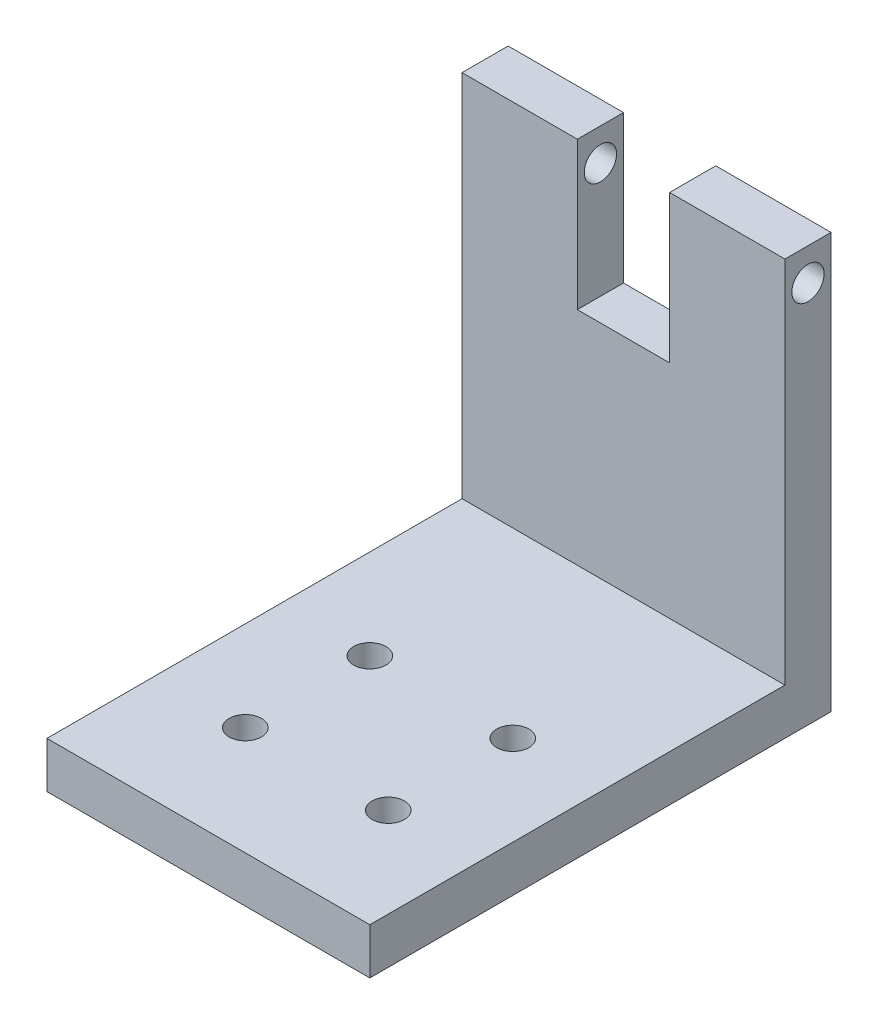
ISO-10303-21;
HEADER;
FILE_DESCRIPTION(('STEP AP214'),'2;1');
FILE_NAME('part.step','',(''),(''),'','','');
FILE_SCHEMA(('AUTOMOTIVE_DESIGN { 1 0 10303 214 1 1 1 1 }'));
ENDSEC;
DATA;
#1=APPLICATION_CONTEXT('core data for automotive mechanical design processes');
#2=APPLICATION_PROTOCOL_DEFINITION('international standard','automotive_design',2000,#1);
#3=PRODUCT_CONTEXT('',#1,'mechanical');
#4=PRODUCT('Part','Part','',(#3));
#5=PRODUCT_RELATED_PRODUCT_CATEGORY('part','',(#4));
#6=PRODUCT_DEFINITION_FORMATION('','',#4);
#7=PRODUCT_DEFINITION_CONTEXT('part definition',#1,'design');
#8=PRODUCT_DEFINITION('design','',#6,#7);
#9=PRODUCT_DEFINITION_SHAPE('','',#8);
#10=(LENGTH_UNIT() NAMED_UNIT(*) SI_UNIT(.MILLI.,.METRE.));
#11=(NAMED_UNIT(*) PLANE_ANGLE_UNIT() SI_UNIT($,.RADIAN.));
#12=(NAMED_UNIT(*) SI_UNIT($,.STERADIAN.) SOLID_ANGLE_UNIT());
#13=UNCERTAINTY_MEASURE_WITH_UNIT(LENGTH_MEASURE(1.E-05),#10,'distance_accuracy_value','');
#14=(GEOMETRIC_REPRESENTATION_CONTEXT(3) GLOBAL_UNCERTAINTY_ASSIGNED_CONTEXT((#13)) GLOBAL_UNIT_ASSIGNED_CONTEXT((#10,
#11,#12)) REPRESENTATION_CONTEXT('',''));
#15=CARTESIAN_POINT('',(0.,0.,0.));
#16=DIRECTION('',(0.,0.,1.));
#17=DIRECTION('',(1.,0.,0.));
#18=AXIS2_PLACEMENT_3D('',#15,#16,#17);
#19=CARTESIAN_POINT('',(0.,5.,0.));
#20=DIRECTION('',(0.,-1.,0.));
#21=DIRECTION('',(0.,0.,-1.));
#22=AXIS2_PLACEMENT_3D('',#19,#20,#21);
#23=PLANE('',#22);
#24=CARTESIAN_POINT('',(9.74999999999999,5.,-11.75));
#25=DIRECTION('',(0.,1.,0.));
#26=DIRECTION('',(0.,0.,1.));
#27=AXIS2_PLACEMENT_3D('',#24,#25,#26);
#28=CIRCLE('',#27,1.75);
#29=CARTESIAN_POINT('',(9.74999999999999,5.,-10.));
#30=VERTEX_POINT('',#29);
#31=EDGE_CURVE('E165',#30,#30,#28,.T.);
#32=ORIENTED_EDGE('',*,*,#31,.F.);
#33=EDGE_LOOP('',(#32));
#34=FACE_BOUND('',#33,.T.);
#35=CARTESIAN_POINT('',(25.25,5.,-25.25));
#36=DIRECTION('',(0.,1.,0.));
#37=DIRECTION('',(0.,0.,-1.));
#38=AXIS2_PLACEMENT_3D('',#35,#36,#37);
#39=CIRCLE('',#38,1.75);
#40=CARTESIAN_POINT('',(25.25,5.,-27.));
#41=VERTEX_POINT('',#40);
#42=EDGE_CURVE('E147',#41,#41,#39,.T.);
#43=ORIENTED_EDGE('',*,*,#42,.F.);
#44=EDGE_LOOP('',(#43));
#45=FACE_BOUND('',#44,.T.);
#46=CARTESIAN_POINT('',(25.25,5.,-11.75));
#47=DIRECTION('',(0.,1.,0.));
#48=DIRECTION('',(0.,0.,-1.));
#49=AXIS2_PLACEMENT_3D('',#46,#47,#48);
#50=CIRCLE('',#49,1.75);
#51=CARTESIAN_POINT('',(25.25,5.,-13.5));
#52=VERTEX_POINT('',#51);
#53=EDGE_CURVE('E157',#52,#52,#50,.T.);
#54=ORIENTED_EDGE('',*,*,#53,.F.);
#55=EDGE_LOOP('',(#54));
#56=FACE_BOUND('',#55,.T.);
#57=CARTESIAN_POINT('',(9.74999999999999,5.,-25.25));
#58=DIRECTION('',(0.,1.,0.));
#59=DIRECTION('',(0.,0.,1.));
#60=AXIS2_PLACEMENT_3D('',#57,#58,#59);
#61=CIRCLE('',#60,1.75);
#62=CARTESIAN_POINT('',(9.74999999999999,5.,-23.5));
#63=VERTEX_POINT('',#62);
#64=EDGE_CURVE('E166',#63,#63,#61,.T.);
#65=ORIENTED_EDGE('',*,*,#64,.F.);
#66=EDGE_LOOP('',(#65));
#67=FACE_BOUND('',#66,.T.);
#68=DIRECTION('',(0.,0.,-1.));
#69=VECTOR('',#68,1.);
#70=CARTESIAN_POINT('',(35.,5.,0.));
#71=LINE('',#70,#69);
#72=CARTESIAN_POINT('',(35.,5.,0.));
#73=VERTEX_POINT('',#72);
#74=CARTESIAN_POINT('',(35.,5.,-45.));
#75=VERTEX_POINT('',#74);
#76=EDGE_CURVE('E192',#73,#75,#71,.T.);
#77=ORIENTED_EDGE('',*,*,#76,.T.);
#78=DIRECTION('',(1.,0.,0.));
#79=VECTOR('',#78,1.);
#80=CARTESIAN_POINT('',(0.,5.,-45.));
#81=LINE('',#80,#79);
#82=CARTESIAN_POINT('',(0.,5.,-45.));
#83=VERTEX_POINT('',#82);
#84=EDGE_CURVE('E64',#83,#75,#81,.T.);
#85=ORIENTED_EDGE('',*,*,#84,.F.);
#86=DIRECTION('',(0.,0.,1.));
#87=VECTOR('',#86,1.);
#88=CARTESIAN_POINT('',(0.,5.,0.));
#89=LINE('',#88,#87);
#90=CARTESIAN_POINT('',(0.,5.,0.));
#91=VERTEX_POINT('',#90);
#92=EDGE_CURVE('E185',#83,#91,#89,.T.);
#93=ORIENTED_EDGE('',*,*,#92,.T.);
#94=DIRECTION('',(1.,0.,0.));
#95=VECTOR('',#94,1.);
#96=CARTESIAN_POINT('',(0.,5.,0.));
#97=LINE('',#96,#95);
#98=EDGE_CURVE('E188',#91,#73,#97,.T.);
#99=ORIENTED_EDGE('',*,*,#98,.T.);
#100=EDGE_LOOP('',(#77,#85,#93,#99));
#101=FACE_BOUND('',#100,.T.);
#102=ADVANCED_FACE('F39',(#34,#45,#56,#67,#101),#23,.F.);
#103=CARTESIAN_POINT('',(0.,5.,0.));
#104=DIRECTION('',(1.,0.,0.));
#105=DIRECTION('',(0.,0.,-1.));
#106=AXIS2_PLACEMENT_3D('',#103,#104,#105);
#107=PLANE('',#106);
#108=CARTESIAN_POINT('',(0.,41.5,-47.5));
#109=DIRECTION('',(-1.,0.,0.));
#110=DIRECTION('',(0.,0.,1.));
#111=AXIS2_PLACEMENT_3D('',#108,#109,#110);
#112=CIRCLE('',#111,1.75);
#113=CARTESIAN_POINT('',(0.,41.5,-45.75));
#114=VERTEX_POINT('',#113);
#115=EDGE_CURVE('E287',#114,#114,#112,.T.);
#116=ORIENTED_EDGE('',*,*,#115,.F.);
#117=EDGE_LOOP('',(#116));
#118=FACE_BOUND('',#117,.T.);
#119=DIRECTION('',(0.,0.,1.));
#120=VECTOR('',#119,1.);
#121=CARTESIAN_POINT('',(0.,0.,0.));
#122=LINE('',#121,#120);
#123=CARTESIAN_POINT('',(0.,0.,-50.));
#124=VERTEX_POINT('',#123);
#125=CARTESIAN_POINT('',(0.,0.,0.));
#126=VERTEX_POINT('',#125);
#127=EDGE_CURVE('E181',#124,#126,#122,.T.);
#128=ORIENTED_EDGE('',*,*,#127,.T.);
#129=DIRECTION('',(0.,-1.,0.));
#130=VECTOR('',#129,1.);
#131=CARTESIAN_POINT('',(0.,5.,0.));
#132=LINE('',#131,#130);
#133=EDGE_CURVE('E11',#91,#126,#132,.T.);
#134=ORIENTED_EDGE('',*,*,#133,.F.);
#135=ORIENTED_EDGE('',*,*,#92,.F.);
#136=DIRECTION('',(0.,-1.,0.));
#137=VECTOR('',#136,1.);
#138=CARTESIAN_POINT('',(0.,45.,-45.));
#139=LINE('',#138,#137);
#140=CARTESIAN_POINT('',(0.,45.,-45.));
#141=VERTEX_POINT('',#140);
#142=EDGE_CURVE('E142',#141,#83,#139,.T.);
#143=ORIENTED_EDGE('',*,*,#142,.F.);
#144=DIRECTION('',(0.,0.,1.));
#145=VECTOR('',#144,1.);
#146=CARTESIAN_POINT('',(0.,45.,-50.));
#147=LINE('',#146,#145);
#148=CARTESIAN_POINT('',(0.,45.,-50.));
#149=VERTEX_POINT('',#148);
#150=EDGE_CURVE('E238',#149,#141,#147,.T.);
#151=ORIENTED_EDGE('',*,*,#150,.F.);
#152=DIRECTION('',(0.,-1.,0.));
#153=VECTOR('',#152,1.);
#154=CARTESIAN_POINT('',(0.,5.,-50.));
#155=LINE('',#154,#153);
#156=EDGE_CURVE('E195',#149,#124,#155,.T.);
#157=ORIENTED_EDGE('',*,*,#156,.T.);
#158=EDGE_LOOP('',(#128,#134,#135,#143,#151,#157));
#159=FACE_BOUND('',#158,.T.);
#160=ADVANCED_FACE('F41',(#118,#159),#107,.F.);
#161=CARTESIAN_POINT('',(0.,5.,0.));
#162=DIRECTION('',(0.,0.,-1.));
#163=DIRECTION('',(-1.,0.,0.));
#164=AXIS2_PLACEMENT_3D('',#161,#162,#163);
#165=PLANE('',#164);
#166=DIRECTION('',(1.,0.,0.));
#167=VECTOR('',#166,1.);
#168=CARTESIAN_POINT('',(0.,0.,0.));
#169=LINE('',#168,#167);
#170=CARTESIAN_POINT('',(35.,0.,0.));
#171=VERTEX_POINT('',#170);
#172=EDGE_CURVE('E199',#126,#171,#169,.T.);
#173=ORIENTED_EDGE('',*,*,#172,.T.);
#174=DIRECTION('',(0.,-1.,0.));
#175=VECTOR('',#174,1.);
#176=CARTESIAN_POINT('',(35.,5.,0.));
#177=LINE('',#176,#175);
#178=EDGE_CURVE('E49',#73,#171,#177,.T.);
#179=ORIENTED_EDGE('',*,*,#178,.F.);
#180=ORIENTED_EDGE('',*,*,#98,.F.);
#181=ORIENTED_EDGE('',*,*,#133,.T.);
#182=EDGE_LOOP('',(#173,#179,#180,#181));
#183=FACE_BOUND('',#182,.T.);
#184=ADVANCED_FACE('F319',(#183),#165,.F.);
#185=CARTESIAN_POINT('',(35.,5.,0.));
#186=DIRECTION('',(-1.,0.,0.));
#187=DIRECTION('',(0.,0.,1.));
#188=AXIS2_PLACEMENT_3D('',#185,#186,#187);
#189=PLANE('',#188);
#190=CARTESIAN_POINT('',(35.,41.5,-47.5));
#191=DIRECTION('',(-1.,0.,0.));
#192=DIRECTION('',(0.,0.,1.));
#193=AXIS2_PLACEMENT_3D('',#190,#191,#192);
#194=CIRCLE('',#193,1.75);
#195=CARTESIAN_POINT('',(35.,41.5,-45.75));
#196=VERTEX_POINT('',#195);
#197=EDGE_CURVE('E291',#196,#196,#194,.T.);
#198=ORIENTED_EDGE('',*,*,#197,.T.);
#199=EDGE_LOOP('',(#198));
#200=FACE_BOUND('',#199,.T.);
#201=DIRECTION('',(0.,0.,-1.));
#202=VECTOR('',#201,1.);
#203=CARTESIAN_POINT('',(35.,0.,0.));
#204=LINE('',#203,#202);
#205=CARTESIAN_POINT('',(35.,0.,-50.));
#206=VERTEX_POINT('',#205);
#207=EDGE_CURVE('E202',#171,#206,#204,.T.);
#208=ORIENTED_EDGE('',*,*,#207,.T.);
#209=DIRECTION('',(0.,-1.,0.));
#210=VECTOR('',#209,1.);
#211=CARTESIAN_POINT('',(35.,5.,-50.));
#212=LINE('',#211,#210);
#213=CARTESIAN_POINT('',(35.,45.,-50.));
#214=VERTEX_POINT('',#213);
#215=EDGE_CURVE('E210',#214,#206,#212,.T.);
#216=ORIENTED_EDGE('',*,*,#215,.F.);
#217=DIRECTION('',(0.,0.,-1.));
#218=VECTOR('',#217,1.);
#219=CARTESIAN_POINT('',(35.,45.,-50.));
#220=LINE('',#219,#218);
#221=CARTESIAN_POINT('',(35.,45.,-45.));
#222=VERTEX_POINT('',#221);
#223=EDGE_CURVE('E275',#222,#214,#220,.T.);
#224=ORIENTED_EDGE('',*,*,#223,.F.);
#225=DIRECTION('',(0.,-1.,0.));
#226=VECTOR('',#225,1.);
#227=CARTESIAN_POINT('',(35.,45.,-45.));
#228=LINE('',#227,#226);
#229=EDGE_CURVE('E247',#222,#75,#228,.T.);
#230=ORIENTED_EDGE('',*,*,#229,.T.);
#231=ORIENTED_EDGE('',*,*,#76,.F.);
#232=ORIENTED_EDGE('',*,*,#178,.T.);
#233=EDGE_LOOP('',(#208,#216,#224,#230,#231,#232));
#234=FACE_BOUND('',#233,.T.);
#235=ADVANCED_FACE('F220',(#200,#234),#189,.F.);
#236=CARTESIAN_POINT('',(0.,5.,-50.));
#237=DIRECTION('',(0.,0.,1.));
#238=DIRECTION('',(1.,0.,0.));
#239=AXIS2_PLACEMENT_3D('',#236,#237,#238);
#240=PLANE('',#239);
#241=DIRECTION('',(-1.,0.,0.));
#242=VECTOR('',#241,1.);
#243=CARTESIAN_POINT('',(0.,0.,-50.));
#244=LINE('',#243,#242);
#245=EDGE_CURVE('E189',#206,#124,#244,.T.);
#246=ORIENTED_EDGE('',*,*,#245,.T.);
#247=ORIENTED_EDGE('',*,*,#156,.F.);
#248=DIRECTION('',(-1.,0.,0.));
#249=VECTOR('',#248,1.);
#250=CARTESIAN_POINT('',(0.,45.,-50.));
#251=LINE('',#250,#249);
#252=CARTESIAN_POINT('',(12.5,45.,-50.));
#253=VERTEX_POINT('',#252);
#254=EDGE_CURVE('E149',#253,#149,#251,.T.);
#255=ORIENTED_EDGE('',*,*,#254,.F.);
#256=DIRECTION('',(0.,-1.,0.));
#257=VECTOR('',#256,1.);
#258=CARTESIAN_POINT('',(12.5,45.,-50.));
#259=LINE('',#258,#257);
#260=CARTESIAN_POINT('',(12.5,29.,-50.));
#261=VERTEX_POINT('',#260);
#262=EDGE_CURVE('E143',#253,#261,#259,.T.);
#263=ORIENTED_EDGE('',*,*,#262,.T.);
#264=DIRECTION('',(-1.,0.,0.));
#265=VECTOR('',#264,1.);
#266=CARTESIAN_POINT('',(12.5,29.,-50.));
#267=LINE('',#266,#265);
#268=CARTESIAN_POINT('',(22.5,29.,-50.));
#269=VERTEX_POINT('',#268);
#270=EDGE_CURVE('E132',#269,#261,#267,.T.);
#271=ORIENTED_EDGE('',*,*,#270,.F.);
#272=DIRECTION('',(0.,-1.,0.));
#273=VECTOR('',#272,1.);
#274=CARTESIAN_POINT('',(22.5,45.,-50.));
#275=LINE('',#274,#273);
#276=CARTESIAN_POINT('',(22.5,45.,-50.));
#277=VERTEX_POINT('',#276);
#278=EDGE_CURVE('E257',#277,#269,#275,.T.);
#279=ORIENTED_EDGE('',*,*,#278,.F.);
#280=DIRECTION('',(-1.,0.,0.));
#281=VECTOR('',#280,1.);
#282=CARTESIAN_POINT('',(22.5,45.,-50.));
#283=LINE('',#282,#281);
#284=EDGE_CURVE('E272',#214,#277,#283,.T.);
#285=ORIENTED_EDGE('',*,*,#284,.F.);
#286=ORIENTED_EDGE('',*,*,#215,.T.);
#287=EDGE_LOOP('',(#246,#247,#255,#263,#271,#279,#285,#286));
#288=FACE_BOUND('',#287,.T.);
#289=ADVANCED_FACE('F229',(#288),#240,.F.);
#290=CARTESIAN_POINT('',(0.,0.,0.));
#291=DIRECTION('',(0.,-1.,0.));
#292=DIRECTION('',(0.,0.,-1.));
#293=AXIS2_PLACEMENT_3D('',#290,#291,#292);
#294=PLANE('',#293);
#295=CARTESIAN_POINT('',(9.74999999999999,0.,-25.25));
#296=DIRECTION('',(0.,1.,0.));
#297=DIRECTION('',(0.,0.,1.));
#298=AXIS2_PLACEMENT_3D('',#295,#296,#297);
#299=CIRCLE('',#298,1.75);
#300=CARTESIAN_POINT('',(9.74999999999999,0.,-23.5));
#301=VERTEX_POINT('',#300);
#302=EDGE_CURVE('E161',#301,#301,#299,.T.);
#303=ORIENTED_EDGE('',*,*,#302,.T.);
#304=EDGE_LOOP('',(#303));
#305=FACE_BOUND('',#304,.T.);
#306=CARTESIAN_POINT('',(25.25,0.,-11.75));
#307=DIRECTION('',(0.,1.,0.));
#308=DIRECTION('',(0.,0.,-1.));
#309=AXIS2_PLACEMENT_3D('',#306,#307,#308);
#310=CIRCLE('',#309,1.75);
#311=CARTESIAN_POINT('',(25.25,0.,-13.5));
#312=VERTEX_POINT('',#311);
#313=EDGE_CURVE('E170',#312,#312,#310,.T.);
#314=ORIENTED_EDGE('',*,*,#313,.T.);
#315=EDGE_LOOP('',(#314));
#316=FACE_BOUND('',#315,.T.);
#317=CARTESIAN_POINT('',(25.25,0.,-25.25));
#318=DIRECTION('',(0.,1.,0.));
#319=DIRECTION('',(0.,0.,-1.));
#320=AXIS2_PLACEMENT_3D('',#317,#318,#319);
#321=CIRCLE('',#320,1.75);
#322=CARTESIAN_POINT('',(25.25,0.,-27.));
#323=VERTEX_POINT('',#322);
#324=EDGE_CURVE('E153',#323,#323,#321,.T.);
#325=ORIENTED_EDGE('',*,*,#324,.T.);
#326=EDGE_LOOP('',(#325));
#327=FACE_BOUND('',#326,.T.);
#328=CARTESIAN_POINT('',(9.74999999999999,0.,-11.75));
#329=DIRECTION('',(0.,1.,0.));
#330=DIRECTION('',(0.,0.,1.));
#331=AXIS2_PLACEMENT_3D('',#328,#329,#330);
#332=CIRCLE('',#331,1.75);
#333=CARTESIAN_POINT('',(9.74999999999999,0.,-10.));
#334=VERTEX_POINT('',#333);
#335=EDGE_CURVE('E177',#334,#334,#332,.T.);
#336=ORIENTED_EDGE('',*,*,#335,.T.);
#337=EDGE_LOOP('',(#336));
#338=FACE_BOUND('',#337,.T.);
#339=ORIENTED_EDGE('',*,*,#127,.F.);
#340=ORIENTED_EDGE('',*,*,#245,.F.);
#341=ORIENTED_EDGE('',*,*,#207,.F.);
#342=ORIENTED_EDGE('',*,*,#172,.F.);
#343=EDGE_LOOP('',(#339,#340,#341,#342));
#344=FACE_BOUND('',#343,.T.);
#345=ADVANCED_FACE('F227',(#305,#316,#327,#338,#344),#294,.T.);
#346=CARTESIAN_POINT('',(9.74999999999999,0.,-11.75));
#347=DIRECTION('',(0.,1.,0.));
#348=DIRECTION('',(0.,0.,1.));
#349=AXIS2_PLACEMENT_3D('',#346,#347,#348);
#350=CYLINDRICAL_SURFACE('',#349,1.75);
#351=ORIENTED_EDGE('',*,*,#335,.F.);
#352=EDGE_LOOP('',(#351));
#353=FACE_BOUND('',#352,.T.);
#354=ORIENTED_EDGE('',*,*,#31,.T.);
#355=EDGE_LOOP('',(#354));
#356=FACE_BOUND('',#355,.T.);
#357=ADVANCED_FACE('F325',(#353,#356),#350,.F.);
#358=CARTESIAN_POINT('',(25.25,0.,-25.25));
#359=DIRECTION('',(0.,1.,0.));
#360=DIRECTION('',(0.,0.,1.));
#361=AXIS2_PLACEMENT_3D('',#358,#359,#360);
#362=CYLINDRICAL_SURFACE('',#361,1.75);
#363=ORIENTED_EDGE('',*,*,#324,.F.);
#364=EDGE_LOOP('',(#363));
#365=FACE_BOUND('',#364,.T.);
#366=ORIENTED_EDGE('',*,*,#42,.T.);
#367=EDGE_LOOP('',(#366));
#368=FACE_BOUND('',#367,.T.);
#369=ADVANCED_FACE('F353',(#365,#368),#362,.F.);
#370=CARTESIAN_POINT('',(25.25,0.,-11.75));
#371=DIRECTION('',(0.,1.,0.));
#372=DIRECTION('',(0.,0.,1.));
#373=AXIS2_PLACEMENT_3D('',#370,#371,#372);
#374=CYLINDRICAL_SURFACE('',#373,1.75);
#375=ORIENTED_EDGE('',*,*,#313,.F.);
#376=EDGE_LOOP('',(#375));
#377=FACE_BOUND('',#376,.T.);
#378=ORIENTED_EDGE('',*,*,#53,.T.);
#379=EDGE_LOOP('',(#378));
#380=FACE_BOUND('',#379,.T.);
#381=ADVANCED_FACE('F356',(#377,#380),#374,.F.);
#382=CARTESIAN_POINT('',(9.74999999999999,0.,-25.25));
#383=DIRECTION('',(0.,1.,0.));
#384=DIRECTION('',(0.,0.,1.));
#385=AXIS2_PLACEMENT_3D('',#382,#383,#384);
#386=CYLINDRICAL_SURFACE('',#385,1.75);
#387=ORIENTED_EDGE('',*,*,#302,.F.);
#388=EDGE_LOOP('',(#387));
#389=FACE_BOUND('',#388,.T.);
#390=ORIENTED_EDGE('',*,*,#64,.T.);
#391=EDGE_LOOP('',(#390));
#392=FACE_BOUND('',#391,.T.);
#393=ADVANCED_FACE('F352',(#389,#392),#386,.F.);
#394=CARTESIAN_POINT('',(0.,45.,-45.));
#395=DIRECTION('',(0.,0.,-1.));
#396=DIRECTION('',(-1.,0.,0.));
#397=AXIS2_PLACEMENT_3D('',#394,#395,#396);
#398=PLANE('',#397);
#399=ORIENTED_EDGE('',*,*,#84,.T.);
#400=ORIENTED_EDGE('',*,*,#229,.F.);
#401=DIRECTION('',(1.,0.,0.));
#402=VECTOR('',#401,1.);
#403=CARTESIAN_POINT('',(22.5,45.,-45.));
#404=LINE('',#403,#402);
#405=CARTESIAN_POINT('',(22.5,45.,-45.));
#406=VERTEX_POINT('',#405);
#407=EDGE_CURVE('E260',#406,#222,#404,.T.);
#408=ORIENTED_EDGE('',*,*,#407,.F.);
#409=DIRECTION('',(0.,-1.,0.));
#410=VECTOR('',#409,1.);
#411=CARTESIAN_POINT('',(22.5,45.,-45.));
#412=LINE('',#411,#410);
#413=CARTESIAN_POINT('',(22.5,29.,-45.));
#414=VERTEX_POINT('',#413);
#415=EDGE_CURVE('E124',#406,#414,#412,.T.);
#416=ORIENTED_EDGE('',*,*,#415,.T.);
#417=DIRECTION('',(1.,0.,0.));
#418=VECTOR('',#417,1.);
#419=CARTESIAN_POINT('',(12.5,29.,-45.));
#420=LINE('',#419,#418);
#421=CARTESIAN_POINT('',(12.5,29.,-45.));
#422=VERTEX_POINT('',#421);
#423=EDGE_CURVE('E56',#422,#414,#420,.T.);
#424=ORIENTED_EDGE('',*,*,#423,.F.);
#425=DIRECTION('',(0.,-1.,0.));
#426=VECTOR('',#425,1.);
#427=CARTESIAN_POINT('',(12.5,45.,-45.));
#428=LINE('',#427,#426);
#429=CARTESIAN_POINT('',(12.5,45.,-45.));
#430=VERTEX_POINT('',#429);
#431=EDGE_CURVE('E120',#430,#422,#428,.T.);
#432=ORIENTED_EDGE('',*,*,#431,.F.);
#433=DIRECTION('',(1.,0.,0.));
#434=VECTOR('',#433,1.);
#435=CARTESIAN_POINT('',(0.,45.,-45.));
#436=LINE('',#435,#434);
#437=EDGE_CURVE('E242',#141,#430,#436,.T.);
#438=ORIENTED_EDGE('',*,*,#437,.F.);
#439=ORIENTED_EDGE('',*,*,#142,.T.);
#440=EDGE_LOOP('',(#399,#400,#408,#416,#424,#432,#438,#439));
#441=FACE_BOUND('',#440,.T.);
#442=ADVANCED_FACE('F118',(#441),#398,.F.);
#443=CARTESIAN_POINT('',(12.5,45.,-50.));
#444=DIRECTION('',(-1.,0.,0.));
#445=DIRECTION('',(0.,0.,1.));
#446=AXIS2_PLACEMENT_3D('',#443,#444,#445);
#447=PLANE('',#446);
#448=CARTESIAN_POINT('',(12.5,41.5,-47.5));
#449=DIRECTION('',(-1.,0.,0.));
#450=DIRECTION('',(0.,0.,1.));
#451=AXIS2_PLACEMENT_3D('',#448,#449,#450);
#452=CIRCLE('',#451,1.75);
#453=CARTESIAN_POINT('',(12.5,41.5,-45.75));
#454=VERTEX_POINT('',#453);
#455=EDGE_CURVE('E137',#454,#454,#452,.T.);
#456=ORIENTED_EDGE('',*,*,#455,.T.);
#457=EDGE_LOOP('',(#456));
#458=FACE_BOUND('',#457,.T.);
#459=ORIENTED_EDGE('',*,*,#431,.T.);
#460=DIRECTION('',(0.,0.,1.));
#461=VECTOR('',#460,1.);
#462=CARTESIAN_POINT('',(12.5,29.,-50.));
#463=LINE('',#462,#461);
#464=EDGE_CURVE('E127',#261,#422,#463,.T.);
#465=ORIENTED_EDGE('',*,*,#464,.F.);
#466=ORIENTED_EDGE('',*,*,#262,.F.);
#467=DIRECTION('',(0.,0.,-1.));
#468=VECTOR('',#467,1.);
#469=CARTESIAN_POINT('',(12.5,45.,-50.));
#470=LINE('',#469,#468);
#471=EDGE_CURVE('E140',#430,#253,#470,.T.);
#472=ORIENTED_EDGE('',*,*,#471,.F.);
#473=EDGE_LOOP('',(#459,#465,#466,#472));
#474=FACE_BOUND('',#473,.T.);
#475=ADVANCED_FACE('F139',(#458,#474),#447,.F.);
#476=CARTESIAN_POINT('',(0.,45.,0.));
#477=DIRECTION('',(0.,1.,0.));
#478=DIRECTION('',(0.,0.,1.));
#479=AXIS2_PLACEMENT_3D('',#476,#477,#478);
#480=PLANE('',#479);
#481=ORIENTED_EDGE('',*,*,#150,.T.);
#482=ORIENTED_EDGE('',*,*,#437,.T.);
#483=ORIENTED_EDGE('',*,*,#471,.T.);
#484=ORIENTED_EDGE('',*,*,#254,.T.);
#485=EDGE_LOOP('',(#481,#482,#483,#484));
#486=FACE_BOUND('',#485,.T.);
#487=ADVANCED_FACE('F254',(#486),#480,.T.);
#488=CARTESIAN_POINT('',(22.5,45.,-45.));
#489=DIRECTION('',(1.,0.,0.));
#490=DIRECTION('',(0.,0.,-1.));
#491=AXIS2_PLACEMENT_3D('',#488,#489,#490);
#492=PLANE('',#491);
#493=CARTESIAN_POINT('',(22.5,41.5,-47.5));
#494=DIRECTION('',(1.,0.,0.));
#495=DIRECTION('',(0.,0.,-1.));
#496=AXIS2_PLACEMENT_3D('',#493,#494,#495);
#497=CIRCLE('',#496,1.75);
#498=CARTESIAN_POINT('',(22.5,41.5,-49.25));
#499=VERTEX_POINT('',#498);
#500=EDGE_CURVE('E43',#499,#499,#497,.T.);
#501=ORIENTED_EDGE('',*,*,#500,.T.);
#502=EDGE_LOOP('',(#501));
#503=FACE_BOUND('',#502,.T.);
#504=ORIENTED_EDGE('',*,*,#278,.T.);
#505=DIRECTION('',(0.,0.,-1.));
#506=VECTOR('',#505,1.);
#507=CARTESIAN_POINT('',(22.5,29.,-50.));
#508=LINE('',#507,#506);
#509=EDGE_CURVE('E126',#414,#269,#508,.T.);
#510=ORIENTED_EDGE('',*,*,#509,.F.);
#511=ORIENTED_EDGE('',*,*,#415,.F.);
#512=DIRECTION('',(0.,0.,1.));
#513=VECTOR('',#512,1.);
#514=CARTESIAN_POINT('',(22.5,45.,-45.));
#515=LINE('',#514,#513);
#516=EDGE_CURVE('E264',#277,#406,#515,.T.);
#517=ORIENTED_EDGE('',*,*,#516,.F.);
#518=EDGE_LOOP('',(#504,#510,#511,#517));
#519=FACE_BOUND('',#518,.T.);
#520=ADVANCED_FACE('F263',(#503,#519),#492,.F.);
#521=CARTESIAN_POINT('',(0.,45.,0.));
#522=DIRECTION('',(0.,-1.,0.));
#523=DIRECTION('',(0.,0.,-1.));
#524=AXIS2_PLACEMENT_3D('',#521,#522,#523);
#525=PLANE('',#524);
#526=ORIENTED_EDGE('',*,*,#407,.T.);
#527=ORIENTED_EDGE('',*,*,#223,.T.);
#528=ORIENTED_EDGE('',*,*,#284,.T.);
#529=ORIENTED_EDGE('',*,*,#516,.T.);
#530=EDGE_LOOP('',(#526,#527,#528,#529));
#531=FACE_BOUND('',#530,.T.);
#532=ADVANCED_FACE('F311',(#531),#525,.F.);
#533=CARTESIAN_POINT('',(0.,29.,0.));
#534=DIRECTION('',(0.,1.,0.));
#535=DIRECTION('',(0.,0.,1.));
#536=AXIS2_PLACEMENT_3D('',#533,#534,#535);
#537=PLANE('',#536);
#538=ORIENTED_EDGE('',*,*,#464,.T.);
#539=ORIENTED_EDGE('',*,*,#423,.T.);
#540=ORIENTED_EDGE('',*,*,#509,.T.);
#541=ORIENTED_EDGE('',*,*,#270,.T.);
#542=EDGE_LOOP('',(#538,#539,#540,#541));
#543=FACE_BOUND('',#542,.T.);
#544=ADVANCED_FACE('F130',(#543),#537,.T.);
#545=CARTESIAN_POINT('',(35.,41.5,-47.5));
#546=DIRECTION('',(-1.,0.,0.));
#547=DIRECTION('',(0.,0.,1.));
#548=AXIS2_PLACEMENT_3D('',#545,#546,#547);
#549=CYLINDRICAL_SURFACE('',#548,1.75);
#550=ORIENTED_EDGE('',*,*,#197,.F.);
#551=EDGE_LOOP('',(#550));
#552=FACE_BOUND('',#551,.T.);
#553=ORIENTED_EDGE('',*,*,#500,.F.);
#554=EDGE_LOOP('',(#553));
#555=FACE_BOUND('',#554,.T.);
#556=ADVANCED_FACE('F301',(#552,#555),#549,.F.);
#557=ORIENTED_EDGE('',*,*,#115,.T.);
#558=EDGE_LOOP('',(#557));
#559=FACE_BOUND('',#558,.T.);
#560=ORIENTED_EDGE('',*,*,#455,.F.);
#561=EDGE_LOOP('',(#560));
#562=FACE_BOUND('',#561,.T.);
#563=ADVANCED_FACE('F303',(#559,#562),#549,.F.);
#564=CLOSED_SHELL('',(#102,#160,#184,#235,#289,#345,#357,#369,#381,#393,#442,#475,#487,#520,
#532,#544,#556,#563));
#565=MANIFOLD_SOLID_BREP('B2',#564);
#566=ADVANCED_BREP_SHAPE_REPRESENTATION('',(#18,#565),#14);
#567=SHAPE_DEFINITION_REPRESENTATION(#9,#566);
ENDSEC;
END-ISO-10303-21;
